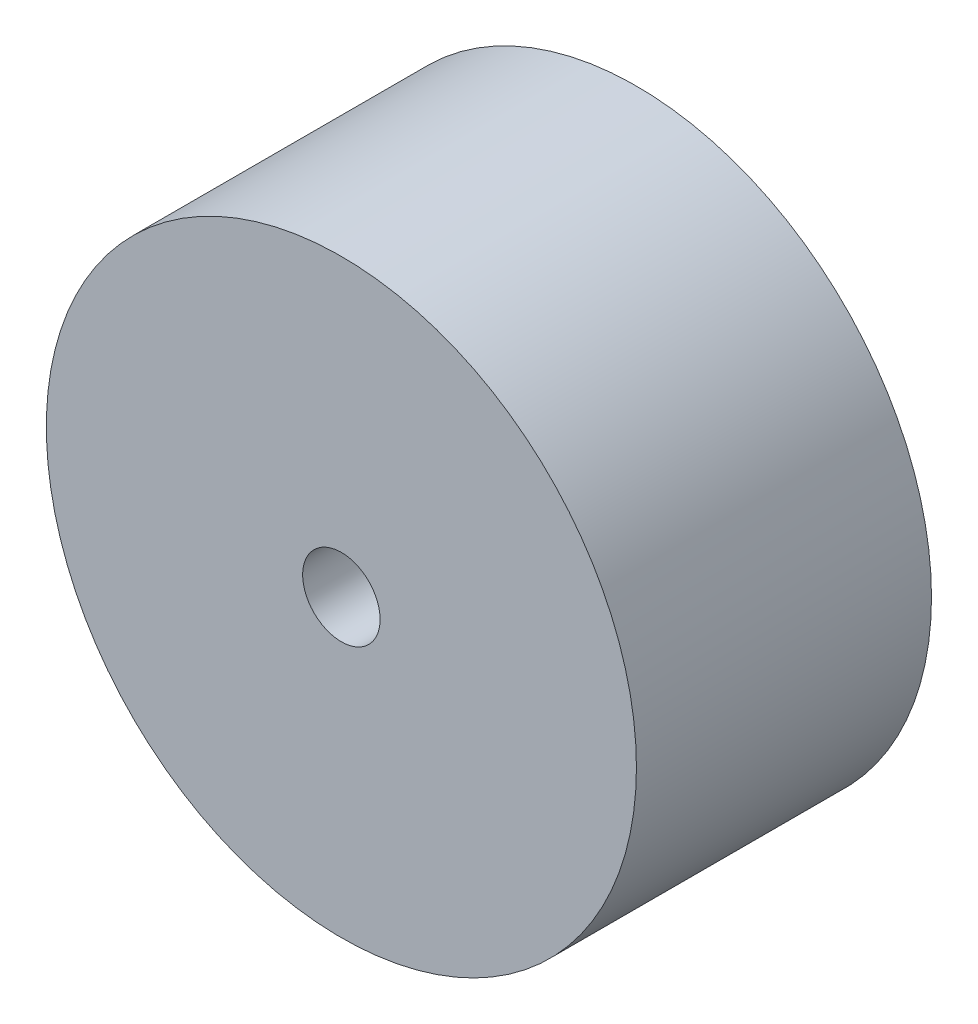
ISO-10303-21;
HEADER;
FILE_DESCRIPTION(('STEP AP214'),'2;1');
FILE_NAME('part.step','',(''),(''),'','','');
FILE_SCHEMA(('AUTOMOTIVE_DESIGN { 1 0 10303 214 1 1 1 1 }'));
ENDSEC;
DATA;
#1=APPLICATION_CONTEXT('core data for automotive mechanical design processes');
#2=APPLICATION_PROTOCOL_DEFINITION('international standard','automotive_design',2000,#1);
#3=PRODUCT_CONTEXT('',#1,'mechanical');
#4=PRODUCT('Part','Part','',(#3));
#5=PRODUCT_RELATED_PRODUCT_CATEGORY('part','',(#4));
#6=PRODUCT_DEFINITION_FORMATION('','',#4);
#7=PRODUCT_DEFINITION_CONTEXT('part definition',#1,'design');
#8=PRODUCT_DEFINITION('design','',#6,#7);
#9=PRODUCT_DEFINITION_SHAPE('','',#8);
#10=(LENGTH_UNIT() NAMED_UNIT(*) SI_UNIT(.MILLI.,.METRE.));
#11=(NAMED_UNIT(*) PLANE_ANGLE_UNIT() SI_UNIT($,.RADIAN.));
#12=(NAMED_UNIT(*) SI_UNIT($,.STERADIAN.) SOLID_ANGLE_UNIT());
#13=UNCERTAINTY_MEASURE_WITH_UNIT(LENGTH_MEASURE(1.E-05),#10,'distance_accuracy_value','');
#14=(GEOMETRIC_REPRESENTATION_CONTEXT(3) GLOBAL_UNCERTAINTY_ASSIGNED_CONTEXT((#13)) GLOBAL_UNIT_ASSIGNED_CONTEXT((#10,
#11,#12)) REPRESENTATION_CONTEXT('',''));
#15=CARTESIAN_POINT('',(0.,0.,0.));
#16=DIRECTION('',(0.,0.,1.));
#17=DIRECTION('',(1.,0.,0.));
#18=AXIS2_PLACEMENT_3D('',#15,#16,#17);
#19=CARTESIAN_POINT('',(0.,0.,19.05));
#20=DIRECTION('',(0.,0.,-1.));
#21=DIRECTION('',(-1.,0.,0.));
#22=AXIS2_PLACEMENT_3D('',#19,#20,#21);
#23=CYLINDRICAL_SURFACE('',#22,2.5);
#24=CARTESIAN_POINT('',(0.,0.,19.05));
#25=DIRECTION('',(0.,0.,1.));
#26=DIRECTION('',(1.,0.,0.));
#27=AXIS2_PLACEMENT_3D('',#24,#25,#26);
#28=CIRCLE('',#27,2.5);
#29=CARTESIAN_POINT('',(2.5,0.,19.05));
#30=VERTEX_POINT('',#29);
#31=EDGE_CURVE('E47',#30,#30,#28,.T.);
#32=ORIENTED_EDGE('',*,*,#31,.T.);
#33=EDGE_LOOP('',(#32));
#34=FACE_BOUND('',#33,.T.);
#35=CARTESIAN_POINT('',(0.,0.,0.));
#36=DIRECTION('',(0.,0.,1.));
#37=DIRECTION('',(1.,0.,0.));
#38=AXIS2_PLACEMENT_3D('',#35,#36,#37);
#39=CIRCLE('',#38,2.5);
#40=CARTESIAN_POINT('',(2.5,0.,0.));
#41=VERTEX_POINT('',#40);
#42=EDGE_CURVE('E54',#41,#41,#39,.T.);
#43=ORIENTED_EDGE('',*,*,#42,.F.);
#44=EDGE_LOOP('',(#43));
#45=FACE_BOUND('',#44,.T.);
#46=ADVANCED_FACE('F39',(#34,#45),#23,.F.);
#47=CARTESIAN_POINT('',(0.,0.,19.05));
#48=DIRECTION('',(0.,0.,-1.));
#49=DIRECTION('',(-1.,0.,0.));
#50=AXIS2_PLACEMENT_3D('',#47,#48,#49);
#51=CYLINDRICAL_SURFACE('',#50,19.05);
#52=CARTESIAN_POINT('',(0.,0.,19.05));
#53=DIRECTION('',(0.,0.,1.));
#54=DIRECTION('',(1.,0.,0.));
#55=AXIS2_PLACEMENT_3D('',#52,#53,#54);
#56=CIRCLE('',#55,19.05);
#57=CARTESIAN_POINT('',(19.05,0.,19.05));
#58=VERTEX_POINT('',#57);
#59=EDGE_CURVE('E10',#58,#58,#56,.T.);
#60=ORIENTED_EDGE('',*,*,#59,.F.);
#61=EDGE_LOOP('',(#60));
#62=FACE_BOUND('',#61,.T.);
#63=CARTESIAN_POINT('',(0.,0.,0.));
#64=DIRECTION('',(0.,0.,1.));
#65=DIRECTION('',(1.,0.,0.));
#66=AXIS2_PLACEMENT_3D('',#63,#64,#65);
#67=CIRCLE('',#66,19.05);
#68=CARTESIAN_POINT('',(19.05,0.,0.));
#69=VERTEX_POINT('',#68);
#70=EDGE_CURVE('E42',#69,#69,#67,.T.);
#71=ORIENTED_EDGE('',*,*,#70,.T.);
#72=EDGE_LOOP('',(#71));
#73=FACE_BOUND('',#72,.T.);
#74=ADVANCED_FACE('F63',(#62,#73),#51,.T.);
#75=CARTESIAN_POINT('',(0.,0.,19.05));
#76=DIRECTION('',(0.,0.,1.));
#77=DIRECTION('',(1.,0.,0.));
#78=AXIS2_PLACEMENT_3D('',#75,#76,#77);
#79=PLANE('',#78);
#80=ORIENTED_EDGE('',*,*,#31,.F.);
#81=EDGE_LOOP('',(#80));
#82=FACE_BOUND('',#81,.T.);
#83=ORIENTED_EDGE('',*,*,#59,.T.);
#84=EDGE_LOOP('',(#83));
#85=FACE_BOUND('',#84,.T.);
#86=ADVANCED_FACE('F67',(#82,#85),#79,.T.);
#87=CARTESIAN_POINT('',(0.,0.,0.));
#88=DIRECTION('',(0.,0.,1.));
#89=DIRECTION('',(1.,0.,0.));
#90=AXIS2_PLACEMENT_3D('',#87,#88,#89);
#91=PLANE('',#90);
#92=ORIENTED_EDGE('',*,*,#42,.T.);
#93=EDGE_LOOP('',(#92));
#94=FACE_BOUND('',#93,.T.);
#95=ORIENTED_EDGE('',*,*,#70,.F.);
#96=EDGE_LOOP('',(#95));
#97=FACE_BOUND('',#96,.T.);
#98=ADVANCED_FACE('F65',(#94,#97),#91,.F.);
#99=CLOSED_SHELL('',(#46,#74,#86,#98));
#100=MANIFOLD_SOLID_BREP('B2',#99);
#101=ADVANCED_BREP_SHAPE_REPRESENTATION('',(#18,#100),#14);
#102=SHAPE_DEFINITION_REPRESENTATION(#9,#101);
ENDSEC;
END-ISO-10303-21;
